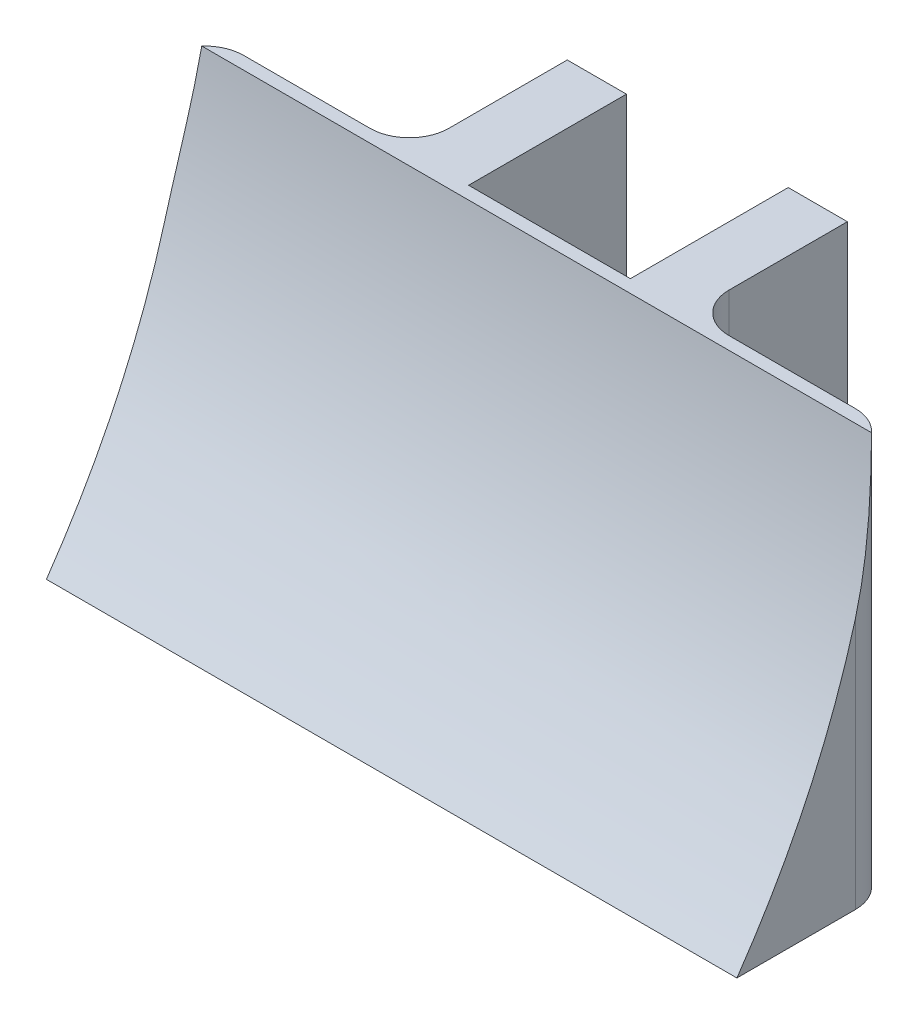
ISO-10303-21;
HEADER;
FILE_DESCRIPTION(('STEP AP214'),'2;1');
FILE_NAME('part.step','',(''),(''),'','','');
FILE_SCHEMA(('AUTOMOTIVE_DESIGN { 1 0 10303 214 1 1 1 1 }'));
ENDSEC;
DATA;
#1=APPLICATION_CONTEXT('core data for automotive mechanical design processes');
#2=APPLICATION_PROTOCOL_DEFINITION('international standard','automotive_design',2000,#1);
#3=PRODUCT_CONTEXT('',#1,'mechanical');
#4=PRODUCT('Part','Part','',(#3));
#5=PRODUCT_RELATED_PRODUCT_CATEGORY('part','',(#4));
#6=PRODUCT_DEFINITION_FORMATION('','',#4);
#7=PRODUCT_DEFINITION_CONTEXT('part definition',#1,'design');
#8=PRODUCT_DEFINITION('design','',#6,#7);
#9=PRODUCT_DEFINITION_SHAPE('','',#8);
#10=(LENGTH_UNIT() NAMED_UNIT(*) SI_UNIT(.MILLI.,.METRE.));
#11=(NAMED_UNIT(*) PLANE_ANGLE_UNIT() SI_UNIT($,.RADIAN.));
#12=(NAMED_UNIT(*) SI_UNIT($,.STERADIAN.) SOLID_ANGLE_UNIT());
#13=UNCERTAINTY_MEASURE_WITH_UNIT(LENGTH_MEASURE(1.E-05),#10,'distance_accuracy_value','');
#14=(GEOMETRIC_REPRESENTATION_CONTEXT(3) GLOBAL_UNCERTAINTY_ASSIGNED_CONTEXT((#13)) GLOBAL_UNIT_ASSIGNED_CONTEXT((#10,
#11,#12)) REPRESENTATION_CONTEXT('',''));
#15=CARTESIAN_POINT('',(0.,0.,0.));
#16=DIRECTION('',(0.,0.,1.));
#17=DIRECTION('',(1.,0.,0.));
#18=AXIS2_PLACEMENT_3D('',#15,#16,#17);
#19=CARTESIAN_POINT('',(0.,0.,8.));
#20=DIRECTION('',(0.,0.,1.));
#21=DIRECTION('',(1.,0.,0.));
#22=AXIS2_PLACEMENT_3D('',#19,#20,#21);
#23=PLANE('',#22);
#24=DIRECTION('',(1.,0.,0.));
#25=VECTOR('',#24,1.);
#26=CARTESIAN_POINT('',(-17.5,-10.,8.));
#27=LINE('',#26,#25);
#28=CARTESIAN_POINT('',(-15.5,-10.,8.));
#29=VERTEX_POINT('',#28);
#30=CARTESIAN_POINT('',(-9.1,-10.,8.));
#31=VERTEX_POINT('',#30);
#32=EDGE_CURVE('E169',#29,#31,#27,.T.);
#33=ORIENTED_EDGE('',*,*,#32,.F.);
#34=DIRECTION('',(0.,-1.,0.));
#35=VECTOR('',#34,1.);
#36=CARTESIAN_POINT('',(-15.5,0.,8.));
#37=LINE('',#36,#35);
#38=CARTESIAN_POINT('',(-15.5,10.,8.));
#39=VERTEX_POINT('',#38);
#40=EDGE_CURVE('E330',#29,#39,#37,.F.);
#41=ORIENTED_EDGE('',*,*,#40,.T.);
#42=DIRECTION('',(-1.,0.,0.));
#43=VECTOR('',#42,1.);
#44=CARTESIAN_POINT('',(-17.5,10.,8.));
#45=LINE('',#44,#43);
#46=CARTESIAN_POINT('',(-9.1,10.,8.));
#47=VERTEX_POINT('',#46);
#48=EDGE_CURVE('E306',#47,#39,#45,.T.);
#49=ORIENTED_EDGE('',*,*,#48,.F.);
#50=DIRECTION('',(0.,-1.,0.));
#51=VECTOR('',#50,1.);
#52=CARTESIAN_POINT('',(-9.1,-10.,8.));
#53=LINE('',#52,#51);
#54=EDGE_CURVE('E331',#47,#31,#53,.T.);
#55=ORIENTED_EDGE('',*,*,#54,.T.);
#56=EDGE_LOOP('',(#33,#41,#49,#55));
#57=FACE_BOUND('',#56,.T.);
#58=ADVANCED_FACE('F45',(#57),#23,.F.);
#59=CARTESIAN_POINT('',(0.,10.,8.));
#60=DIRECTION('',(0.,-1.,0.));
#61=DIRECTION('',(0.,0.,-1.));
#62=AXIS2_PLACEMENT_3D('',#59,#60,#61);
#63=PLANE('',#62);
#64=DIRECTION('',(1.,0.,0.));
#65=VECTOR('',#64,1.);
#66=CARTESIAN_POINT('',(-82.5,9.99999999999999,8.65035068671189));
#67=LINE('',#66,#65);
#68=CARTESIAN_POINT('',(-16.9759562090865,9.99999999999999,8.65035068671189));
#69=VERTEX_POINT('',#68);
#70=CARTESIAN_POINT('',(16.9759562090865,10.,8.65035068671189));
#71=VERTEX_POINT('',#70);
#72=EDGE_CURVE('E178',#69,#71,#67,.T.);
#73=ORIENTED_EDGE('',*,*,#72,.T.);
#74=CARTESIAN_POINT('',(15.5,10.,10.));
#75=DIRECTION('',(0.,-1.,0.));
#76=DIRECTION('',(0.,0.,-1.));
#77=AXIS2_PLACEMENT_3D('',#74,#75,#76);
#78=CIRCLE('',#77,2.);
#79=CARTESIAN_POINT('',(15.5,10.,8.));
#80=VERTEX_POINT('',#79);
#81=EDGE_CURVE('E367',#71,#80,#78,.F.);
#82=ORIENTED_EDGE('',*,*,#81,.T.);
#83=CARTESIAN_POINT('',(9.1,10.,8.));
#84=VERTEX_POINT('',#83);
#85=EDGE_CURVE('E310',#80,#84,#45,.T.);
#86=ORIENTED_EDGE('',*,*,#85,.T.);
#87=CARTESIAN_POINT('',(9.1,10.,6.));
#88=DIRECTION('',(0.,-1.,0.));
#89=DIRECTION('',(0.,0.,-1.));
#90=AXIS2_PLACEMENT_3D('',#87,#88,#89);
#91=CIRCLE('',#90,2.);
#92=CARTESIAN_POINT('',(7.1,10.,6.));
#93=VERTEX_POINT('',#92);
#94=EDGE_CURVE('E11',#84,#93,#91,.T.);
#95=ORIENTED_EDGE('',*,*,#94,.T.);
#96=DIRECTION('',(0.,0.,-1.));
#97=VECTOR('',#96,1.);
#98=CARTESIAN_POINT('',(7.1,10.,8.));
#99=LINE('',#98,#97);
#100=CARTESIAN_POINT('',(7.1,10.,0.));
#101=VERTEX_POINT('',#100);
#102=EDGE_CURVE('E197',#93,#101,#99,.T.);
#103=ORIENTED_EDGE('',*,*,#102,.T.);
#104=DIRECTION('',(-1.,0.,0.));
#105=VECTOR('',#104,1.);
#106=CARTESIAN_POINT('',(0.,10.,0.));
#107=LINE('',#106,#105);
#108=CARTESIAN_POINT('',(4.1,10.,0.));
#109=VERTEX_POINT('',#108);
#110=EDGE_CURVE('E188',#101,#109,#107,.T.);
#111=ORIENTED_EDGE('',*,*,#110,.T.);
#112=DIRECTION('',(0.,0.,-1.));
#113=VECTOR('',#112,1.);
#114=CARTESIAN_POINT('',(4.1,10.,8.));
#115=LINE('',#114,#113);
#116=CARTESIAN_POINT('',(4.1,10.,8.));
#117=VERTEX_POINT('',#116);
#118=EDGE_CURVE('E221',#117,#109,#115,.T.);
#119=ORIENTED_EDGE('',*,*,#118,.F.);
#120=CARTESIAN_POINT('',(-4.1,10.,8.));
#121=VERTEX_POINT('',#120);
#122=EDGE_CURVE('E309',#117,#121,#45,.T.);
#123=ORIENTED_EDGE('',*,*,#122,.T.);
#124=DIRECTION('',(0.,0.,-1.));
#125=VECTOR('',#124,1.);
#126=CARTESIAN_POINT('',(-4.1,10.,8.));
#127=LINE('',#126,#125);
#128=CARTESIAN_POINT('',(-4.1,10.,0.));
#129=VERTEX_POINT('',#128);
#130=EDGE_CURVE('E301',#121,#129,#127,.T.);
#131=ORIENTED_EDGE('',*,*,#130,.T.);
#132=DIRECTION('',(1.,0.,0.));
#133=VECTOR('',#132,1.);
#134=CARTESIAN_POINT('',(0.,10.,0.));
#135=LINE('',#134,#133);
#136=CARTESIAN_POINT('',(-7.1,10.,0.));
#137=VERTEX_POINT('',#136);
#138=EDGE_CURVE('E289',#137,#129,#135,.T.);
#139=ORIENTED_EDGE('',*,*,#138,.F.);
#140=DIRECTION('',(0.,0.,-1.));
#141=VECTOR('',#140,1.);
#142=CARTESIAN_POINT('',(-7.1,10.,8.));
#143=LINE('',#142,#141);
#144=CARTESIAN_POINT('',(-7.1,10.,6.));
#145=VERTEX_POINT('',#144);
#146=EDGE_CURVE('E298',#145,#137,#143,.T.);
#147=ORIENTED_EDGE('',*,*,#146,.F.);
#148=CARTESIAN_POINT('',(-9.1,10.,6.));
#149=DIRECTION('',(0.,-1.,0.));
#150=DIRECTION('',(0.,0.,-1.));
#151=AXIS2_PLACEMENT_3D('',#148,#149,#150);
#152=CIRCLE('',#151,2.);
#153=EDGE_CURVE('E353',#145,#47,#152,.T.);
#154=ORIENTED_EDGE('',*,*,#153,.T.);
#155=ORIENTED_EDGE('',*,*,#48,.T.);
#156=CARTESIAN_POINT('',(-15.5,10.,10.));
#157=DIRECTION('',(0.,-1.,0.));
#158=DIRECTION('',(0.,0.,-1.));
#159=AXIS2_PLACEMENT_3D('',#156,#157,#158);
#160=CIRCLE('',#159,2.);
#161=EDGE_CURVE('E336',#39,#69,#160,.F.);
#162=ORIENTED_EDGE('',*,*,#161,.T.);
#163=EDGE_LOOP('',(#73,#82,#86,#95,#103,#111,#119,#123,#131,#139,#147,#154,#155,#162));
#164=FACE_BOUND('',#163,.T.);
#165=ADVANCED_FACE('F382',(#164),#63,.F.);
#166=CARTESIAN_POINT('',(4.1,0.,8.));
#167=DIRECTION('',(1.,0.,0.));
#168=DIRECTION('',(0.,0.,-1.));
#169=AXIS2_PLACEMENT_3D('',#166,#167,#168);
#170=PLANE('',#169);
#171=DIRECTION('',(0.,-1.,0.));
#172=VECTOR('',#171,1.);
#173=CARTESIAN_POINT('',(4.1,0.,0.));
#174=LINE('',#173,#172);
#175=CARTESIAN_POINT('',(4.1,-10.,0.));
#176=VERTEX_POINT('',#175);
#177=EDGE_CURVE('E202',#109,#176,#174,.T.);
#178=ORIENTED_EDGE('',*,*,#177,.T.);
#179=DIRECTION('',(0.,0.,-1.));
#180=VECTOR('',#179,1.);
#181=CARTESIAN_POINT('',(4.1,-10.,8.));
#182=LINE('',#181,#180);
#183=CARTESIAN_POINT('',(4.1,-10.,8.));
#184=VERTEX_POINT('',#183);
#185=EDGE_CURVE('E218',#184,#176,#182,.T.);
#186=ORIENTED_EDGE('',*,*,#185,.F.);
#187=DIRECTION('',(0.,-1.,0.));
#188=VECTOR('',#187,1.);
#189=CARTESIAN_POINT('',(4.1,0.,8.));
#190=LINE('',#189,#188);
#191=EDGE_CURVE('E193',#117,#184,#190,.T.);
#192=ORIENTED_EDGE('',*,*,#191,.F.);
#193=ORIENTED_EDGE('',*,*,#118,.T.);
#194=EDGE_LOOP('',(#178,#186,#192,#193));
#195=FACE_BOUND('',#194,.T.);
#196=ADVANCED_FACE('F399',(#195),#170,.F.);
#197=CARTESIAN_POINT('',(0.,-10.,8.));
#198=DIRECTION('',(0.,-1.,0.));
#199=DIRECTION('',(0.,0.,-1.));
#200=AXIS2_PLACEMENT_3D('',#197,#198,#199);
#201=PLANE('',#200);
#202=CARTESIAN_POINT('',(9.1,-10.,8.));
#203=VERTEX_POINT('',#202);
#204=CARTESIAN_POINT('',(15.5,-10.,8.));
#205=VERTEX_POINT('',#204);
#206=EDGE_CURVE('E318',#203,#205,#27,.T.);
#207=ORIENTED_EDGE('',*,*,#206,.T.);
#208=CARTESIAN_POINT('',(15.5,-10.,10.));
#209=DIRECTION('',(0.,-1.,0.));
#210=DIRECTION('',(0.,0.,-1.));
#211=AXIS2_PLACEMENT_3D('',#208,#209,#210);
#212=CIRCLE('',#211,2.);
#213=CARTESIAN_POINT('',(17.5,-10.,10.));
#214=VERTEX_POINT('',#213);
#215=EDGE_CURVE('E183',#205,#214,#212,.T.);
#216=ORIENTED_EDGE('',*,*,#215,.T.);
#217=DIRECTION('',(0.,0.,-1.));
#218=VECTOR('',#217,1.);
#219=CARTESIAN_POINT('',(17.5,-10.,16.));
#220=LINE('',#219,#218);
#221=CARTESIAN_POINT('',(17.5,-10.,16.));
#222=VERTEX_POINT('',#221);
#223=EDGE_CURVE('E168',#222,#214,#220,.T.);
#224=ORIENTED_EDGE('',*,*,#223,.F.);
#225=DIRECTION('',(1.,0.,0.));
#226=VECTOR('',#225,1.);
#227=CARTESIAN_POINT('',(-17.5,-10.,16.));
#228=LINE('',#227,#226);
#229=CARTESIAN_POINT('',(-17.5,-10.,16.));
#230=VERTEX_POINT('',#229);
#231=EDGE_CURVE('E158',#230,#222,#228,.T.);
#232=ORIENTED_EDGE('',*,*,#231,.F.);
#233=DIRECTION('',(0.,0.,-1.));
#234=VECTOR('',#233,1.);
#235=CARTESIAN_POINT('',(-17.5,-10.,16.));
#236=LINE('',#235,#234);
#237=CARTESIAN_POINT('',(-17.5,-10.,10.));
#238=VERTEX_POINT('',#237);
#239=EDGE_CURVE('E185',#230,#238,#236,.T.);
#240=ORIENTED_EDGE('',*,*,#239,.T.);
#241=CARTESIAN_POINT('',(-15.5,-10.,10.));
#242=DIRECTION('',(0.,-1.,0.));
#243=DIRECTION('',(0.,0.,-1.));
#244=AXIS2_PLACEMENT_3D('',#241,#242,#243);
#245=CIRCLE('',#244,2.);
#246=EDGE_CURVE('E327',#238,#29,#245,.T.);
#247=ORIENTED_EDGE('',*,*,#246,.T.);
#248=ORIENTED_EDGE('',*,*,#32,.T.);
#249=CARTESIAN_POINT('',(-9.1,-10.,6.));
#250=DIRECTION('',(0.,-1.,0.));
#251=DIRECTION('',(0.,0.,-1.));
#252=AXIS2_PLACEMENT_3D('',#249,#250,#251);
#253=CIRCLE('',#252,2.);
#254=CARTESIAN_POINT('',(-7.1,-10.,6.));
#255=VERTEX_POINT('',#254);
#256=EDGE_CURVE('E61',#31,#255,#253,.F.);
#257=ORIENTED_EDGE('',*,*,#256,.T.);
#258=DIRECTION('',(0.,0.,-1.));
#259=VECTOR('',#258,1.);
#260=CARTESIAN_POINT('',(-7.1,-10.,8.));
#261=LINE('',#260,#259);
#262=CARTESIAN_POINT('',(-7.1,-10.,0.));
#263=VERTEX_POINT('',#262);
#264=EDGE_CURVE('E280',#255,#263,#261,.T.);
#265=ORIENTED_EDGE('',*,*,#264,.T.);
#266=DIRECTION('',(1.,0.,0.));
#267=VECTOR('',#266,1.);
#268=CARTESIAN_POINT('',(0.,-10.,0.));
#269=LINE('',#268,#267);
#270=CARTESIAN_POINT('',(-4.1,-10.,0.));
#271=VERTEX_POINT('',#270);
#272=EDGE_CURVE('E272',#263,#271,#269,.T.);
#273=ORIENTED_EDGE('',*,*,#272,.T.);
#274=DIRECTION('',(0.,0.,-1.));
#275=VECTOR('',#274,1.);
#276=CARTESIAN_POINT('',(-4.1,-10.,8.));
#277=LINE('',#276,#275);
#278=CARTESIAN_POINT('',(-4.1,-10.,8.));
#279=VERTEX_POINT('',#278);
#280=EDGE_CURVE('E304',#279,#271,#277,.T.);
#281=ORIENTED_EDGE('',*,*,#280,.F.);
#282=EDGE_CURVE('E322',#279,#184,#27,.T.);
#283=ORIENTED_EDGE('',*,*,#282,.T.);
#284=ORIENTED_EDGE('',*,*,#185,.T.);
#285=DIRECTION('',(-1.,0.,0.));
#286=VECTOR('',#285,1.);
#287=CARTESIAN_POINT('',(0.,-10.,0.));
#288=LINE('',#287,#286);
#289=CARTESIAN_POINT('',(7.1,-10.,0.));
#290=VERTEX_POINT('',#289);
#291=EDGE_CURVE('E206',#290,#176,#288,.T.);
#292=ORIENTED_EDGE('',*,*,#291,.F.);
#293=DIRECTION('',(0.,0.,-1.));
#294=VECTOR('',#293,1.);
#295=CARTESIAN_POINT('',(7.1,-10.,8.));
#296=LINE('',#295,#294);
#297=CARTESIAN_POINT('',(7.1,-10.,6.));
#298=VERTEX_POINT('',#297);
#299=EDGE_CURVE('E215',#298,#290,#296,.T.);
#300=ORIENTED_EDGE('',*,*,#299,.F.);
#301=CARTESIAN_POINT('',(9.1,-10.,6.));
#302=DIRECTION('',(0.,-1.,0.));
#303=DIRECTION('',(0.,0.,-1.));
#304=AXIS2_PLACEMENT_3D('',#301,#302,#303);
#305=CIRCLE('',#304,2.);
#306=EDGE_CURVE('E54',#298,#203,#305,.F.);
#307=ORIENTED_EDGE('',*,*,#306,.T.);
#308=EDGE_LOOP('',(#207,#216,#224,#232,#240,#247,#248,#257,#265,#273,#281,#283,#284,#292,#300,#307));
#309=FACE_BOUND('',#308,.T.);
#310=ADVANCED_FACE('F181',(#309),#201,.T.);
#311=CARTESIAN_POINT('',(7.1,0.,8.));
#312=DIRECTION('',(1.,0.,0.));
#313=DIRECTION('',(0.,0.,-1.));
#314=AXIS2_PLACEMENT_3D('',#311,#312,#313);
#315=PLANE('',#314);
#316=ORIENTED_EDGE('',*,*,#102,.F.);
#317=DIRECTION('',(0.,-1.,0.));
#318=VECTOR('',#317,1.);
#319=CARTESIAN_POINT('',(7.1,0.,6.));
#320=LINE('',#319,#318);
#321=EDGE_CURVE('E342',#93,#298,#320,.T.);
#322=ORIENTED_EDGE('',*,*,#321,.T.);
#323=ORIENTED_EDGE('',*,*,#299,.T.);
#324=DIRECTION('',(0.,-1.,0.));
#325=VECTOR('',#324,1.);
#326=CARTESIAN_POINT('',(7.1,0.,0.));
#327=LINE('',#326,#325);
#328=EDGE_CURVE('E198',#101,#290,#327,.T.);
#329=ORIENTED_EDGE('',*,*,#328,.F.);
#330=EDGE_LOOP('',(#316,#322,#323,#329));
#331=FACE_BOUND('',#330,.T.);
#332=ADVANCED_FACE('F420',(#331),#315,.T.);
#333=CARTESIAN_POINT('',(0.,0.,0.));
#334=DIRECTION('',(0.,0.,1.));
#335=DIRECTION('',(1.,0.,0.));
#336=AXIS2_PLACEMENT_3D('',#333,#334,#335);
#337=PLANE('',#336);
#338=ORIENTED_EDGE('',*,*,#110,.F.);
#339=ORIENTED_EDGE('',*,*,#328,.T.);
#340=ORIENTED_EDGE('',*,*,#291,.T.);
#341=ORIENTED_EDGE('',*,*,#177,.F.);
#342=EDGE_LOOP('',(#338,#339,#340,#341));
#343=FACE_BOUND('',#342,.T.);
#344=ADVANCED_FACE('F403',(#343),#337,.F.);
#345=ORIENTED_EDGE('',*,*,#282,.F.);
#346=DIRECTION('',(0.,-1.,0.));
#347=VECTOR('',#346,1.);
#348=CARTESIAN_POINT('',(-4.1,0.,8.));
#349=LINE('',#348,#347);
#350=EDGE_CURVE('E273',#121,#279,#349,.T.);
#351=ORIENTED_EDGE('',*,*,#350,.F.);
#352=ORIENTED_EDGE('',*,*,#122,.F.);
#353=ORIENTED_EDGE('',*,*,#191,.T.);
#354=EDGE_LOOP('',(#345,#351,#352,#353));
#355=FACE_BOUND('',#354,.T.);
#356=ADVANCED_FACE('F395',(#355),#23,.F.);
#357=CARTESIAN_POINT('',(17.5,10.,16.));
#358=DIRECTION('',(-1.,0.,0.));
#359=DIRECTION('',(0.,0.,1.));
#360=AXIS2_PLACEMENT_3D('',#357,#358,#359);
#361=PLANE('',#360);
#362=ORIENTED_EDGE('',*,*,#223,.T.);
#363=DIRECTION('',(0.,1.,0.));
#364=VECTOR('',#363,1.);
#365=CARTESIAN_POINT('',(17.5,10.,10.));
#366=LINE('',#365,#364);
#367=CARTESIAN_POINT('',(17.5,2.74793727355855,9.99999999998389));
#368=VERTEX_POINT('',#367);
#369=EDGE_CURVE('E176',#214,#368,#366,.T.);
#370=ORIENTED_EDGE('',*,*,#369,.T.);
#371=CARTESIAN_POINT('',(17.5,-10.,16.));
#372=CARTESIAN_POINT('',(17.5,-0.993319634584633,9.76063905327184));
#373=CARTESIAN_POINT('',(17.5,10.,8.65035068671189));
#374=B_SPLINE_CURVE_WITH_KNOTS('',2,(#371,#372,#373),.UNSPECIFIED.,.F.,.F.,(3,3),(0.,1.),.UNSPECIFIED.);
#375=EDGE_CURVE('E161',#222,#368,#374,.T.);
#376=ORIENTED_EDGE('',*,*,#375,.F.);
#377=EDGE_LOOP('',(#362,#370,#376));
#378=FACE_BOUND('',#377,.T.);
#379=ADVANCED_FACE('F174',(#378),#361,.F.);
#380=CARTESIAN_POINT('',(-17.5,10.,16.));
#381=DIRECTION('',(1.,0.,0.));
#382=DIRECTION('',(0.,0.,-1.));
#383=AXIS2_PLACEMENT_3D('',#380,#381,#382);
#384=PLANE('',#383);
#385=CARTESIAN_POINT('',(-17.5,-10.,16.));
#386=CARTESIAN_POINT('',(-17.5,-0.993319634584633,9.76063905327184));
#387=CARTESIAN_POINT('',(-17.5,10.,8.65035068671189));
#388=B_SPLINE_CURVE_WITH_KNOTS('',2,(#385,#386,#387),.UNSPECIFIED.,.F.,.F.,(3,3),(0.,1.),.UNSPECIFIED.);
#389=CARTESIAN_POINT('',(-17.5,2.74793727355855,9.99999999998389));
#390=VERTEX_POINT('',#389);
#391=EDGE_CURVE('E163',#230,#390,#388,.T.);
#392=ORIENTED_EDGE('',*,*,#391,.T.);
#393=DIRECTION('',(0.,-1.,0.));
#394=VECTOR('',#393,1.);
#395=CARTESIAN_POINT('',(-17.5,10.,10.));
#396=LINE('',#395,#394);
#397=EDGE_CURVE('E344',#390,#238,#396,.T.);
#398=ORIENTED_EDGE('',*,*,#397,.T.);
#399=ORIENTED_EDGE('',*,*,#239,.F.);
#400=EDGE_LOOP('',(#392,#398,#399));
#401=FACE_BOUND('',#400,.T.);
#402=ADVANCED_FACE('F379',(#401),#384,.F.);
#403=ORIENTED_EDGE('',*,*,#85,.F.);
#404=DIRECTION('',(0.,1.,0.));
#405=VECTOR('',#404,1.);
#406=CARTESIAN_POINT('',(15.5,0.,8.));
#407=LINE('',#406,#405);
#408=EDGE_CURVE('E365',#80,#205,#407,.F.);
#409=ORIENTED_EDGE('',*,*,#408,.T.);
#410=ORIENTED_EDGE('',*,*,#206,.F.);
#411=DIRECTION('',(0.,-1.,0.));
#412=VECTOR('',#411,1.);
#413=CARTESIAN_POINT('',(9.1,0.,8.));
#414=LINE('',#413,#412);
#415=EDGE_CURVE('E363',#203,#84,#414,.F.);
#416=ORIENTED_EDGE('',*,*,#415,.T.);
#417=EDGE_LOOP('',(#403,#409,#410,#416));
#418=FACE_BOUND('',#417,.T.);
#419=ADVANCED_FACE('F362',(#418),#23,.F.);
#420=CARTESIAN_POINT('',(-4.1,0.,8.));
#421=DIRECTION('',(1.,0.,0.));
#422=DIRECTION('',(0.,0.,-1.));
#423=AXIS2_PLACEMENT_3D('',#420,#421,#422);
#424=PLANE('',#423);
#425=DIRECTION('',(0.,-1.,0.));
#426=VECTOR('',#425,1.);
#427=CARTESIAN_POINT('',(-4.1,0.,0.));
#428=LINE('',#427,#426);
#429=EDGE_CURVE('E285',#129,#271,#428,.T.);
#430=ORIENTED_EDGE('',*,*,#429,.F.);
#431=ORIENTED_EDGE('',*,*,#130,.F.);
#432=ORIENTED_EDGE('',*,*,#350,.T.);
#433=ORIENTED_EDGE('',*,*,#280,.T.);
#434=EDGE_LOOP('',(#430,#431,#432,#433));
#435=FACE_BOUND('',#434,.T.);
#436=ADVANCED_FACE('F406',(#435),#424,.T.);
#437=CARTESIAN_POINT('',(-7.1,0.,8.));
#438=DIRECTION('',(1.,0.,0.));
#439=DIRECTION('',(0.,0.,-1.));
#440=AXIS2_PLACEMENT_3D('',#437,#438,#439);
#441=PLANE('',#440);
#442=ORIENTED_EDGE('',*,*,#264,.F.);
#443=DIRECTION('',(0.,-1.,0.));
#444=VECTOR('',#443,1.);
#445=CARTESIAN_POINT('',(-7.1,10.,6.));
#446=LINE('',#445,#444);
#447=EDGE_CURVE('E338',#255,#145,#446,.F.);
#448=ORIENTED_EDGE('',*,*,#447,.T.);
#449=ORIENTED_EDGE('',*,*,#146,.T.);
#450=DIRECTION('',(0.,-1.,0.));
#451=VECTOR('',#450,1.);
#452=CARTESIAN_POINT('',(-7.1,0.,0.));
#453=LINE('',#452,#451);
#454=EDGE_CURVE('E281',#137,#263,#453,.T.);
#455=ORIENTED_EDGE('',*,*,#454,.T.);
#456=EDGE_LOOP('',(#442,#448,#449,#455));
#457=FACE_BOUND('',#456,.T.);
#458=ADVANCED_FACE('F411',(#457),#441,.F.);
#459=CARTESIAN_POINT('',(0.,0.,0.));
#460=DIRECTION('',(0.,0.,1.));
#461=DIRECTION('',(1.,0.,0.));
#462=AXIS2_PLACEMENT_3D('',#459,#460,#461);
#463=PLANE('',#462);
#464=ORIENTED_EDGE('',*,*,#272,.F.);
#465=ORIENTED_EDGE('',*,*,#454,.F.);
#466=ORIENTED_EDGE('',*,*,#138,.T.);
#467=ORIENTED_EDGE('',*,*,#429,.T.);
#468=EDGE_LOOP('',(#464,#465,#466,#467));
#469=FACE_BOUND('',#468,.T.);
#470=ADVANCED_FACE('F250',(#469),#463,.F.);
#471=CARTESIAN_POINT('',(-82.5,-10.,16.));
#472=CARTESIAN_POINT('',(-82.5,-0.993319634584633,9.76063905327184));
#473=CARTESIAN_POINT('',(-82.5,10.,8.65035068671189));
#474=B_SPLINE_CURVE_WITH_KNOTS('',2,(#471,#472,#473),.UNSPECIFIED.,.F.,.F.,(3,3),(0.,1.),.UNSPECIFIED.);
#475=DIRECTION('',(1.,0.,0.));
#476=VECTOR('',#475,1.);
#477=SURFACE_OF_LINEAR_EXTRUSION('',#474,#476);
#478=ORIENTED_EDGE('',*,*,#375,.T.);
#479=CARTESIAN_POINT('',(17.5,2.747937273563,10.));
#480=CARTESIAN_POINT('',(17.4999780873082,2.96311641456703,9.94043887519914));
#481=CARTESIAN_POINT('',(17.497340256262,3.17875548604895,9.88260583019924));
#482=CARTESIAN_POINT('',(17.4875825706697,3.61075010720856,9.77042146471678));
#483=CARTESIAN_POINT('',(17.4804644473526,3.82710534804373,9.7160688083115));
#484=CARTESIAN_POINT('',(17.4624956202193,4.26047595169996,9.6108294769491));
#485=CARTESIAN_POINT('',(17.4516452497898,4.47749125384483,9.55994249290352));
#486=CARTESIAN_POINT('',(17.4268697328854,4.91160761386301,9.46173162151336));
#487=CARTESIAN_POINT('',(17.4129519261369,5.12870725254839,9.41439958442343));
#488=CARTESIAN_POINT('',(17.3825976036345,5.56346217340621,9.32314100019821));
#489=CARTESIAN_POINT('',(17.3661608760545,5.7811175007936,9.27921473993646));
#490=CARTESIAN_POINT('',(17.331297453585,6.21692730438456,9.19474400642566));
#491=CARTESIAN_POINT('',(17.312870721701,6.43508178979371,9.15419959607042));
#492=CARTESIAN_POINT('',(17.2774792637091,6.83825692384323,9.08244237597254));
#493=CARTESIAN_POINT('',(17.2607257383788,7.02321175429393,9.05075355822059));
#494=CARTESIAN_POINT('',(17.2264508002172,7.39343397299065,8.98975676569054));
#495=CARTESIAN_POINT('',(17.2089294211418,7.57870134715331,8.96044868641389));
#496=CARTESIAN_POINT('',(17.1734126333568,7.94954583478291,8.904191337327));
#497=CARTESIAN_POINT('',(17.1554172302707,8.13512294455096,8.87724203955055));
#498=CARTESIAN_POINT('',(17.1192114449726,8.50696466051732,8.82562778479478));
#499=CARTESIAN_POINT('',(17.1010006978074,8.69322989626202,8.80096762179216));
#500=CARTESIAN_POINT('',(17.064703269022,9.06606765564129,8.75397237930601));
#501=CARTESIAN_POINT('',(17.0466165887696,9.25264018263569,8.73163732541831));
#502=CARTESIAN_POINT('',(17.0108802630984,9.62609161368902,8.68927116604622));
#503=CARTESIAN_POINT('',(16.9932306251584,9.81297052293253,8.66924009996665));
#504=CARTESIAN_POINT('',(16.9759562090865,10.,8.65035068671189));
#505=B_SPLINE_CURVE_WITH_KNOTS('',3,(#479,#480,#481,#482,#483,#484,#485,#486,#487,#488,#489,
#490,#491,#492,#493,#494,#495,#496,#497,#498,#499,#500,#501,#502,#503,#504),.UNSPECIFIED.,.F.,
.F.,(4,2,2,2,2,2,2,2,2,2,2,2,4),(0.,0.669762945520047,1.33926724680416,2.0087117594641,
2.67657149557604,3.34448742550743,4.01241577420917,4.57758764928373,5.14273470365844,
5.70787505662035,6.27417343371387,6.84047804420905,7.40679233869926),.UNSPECIFIED.);
#506=EDGE_CURVE('E236',#368,#71,#505,.T.);
#507=ORIENTED_EDGE('',*,*,#506,.T.);
#508=ORIENTED_EDGE('',*,*,#72,.F.);
#509=CARTESIAN_POINT('',(-16.9759562090865,9.99999999999999,8.65035068671189));
#510=CARTESIAN_POINT('',(-16.9963440503793,9.7792742347469,8.6726433724123));
#511=CARTESIAN_POINT('',(-17.01725285042,9.55875816047928,8.69652607493841));
#512=CARTESIAN_POINT('',(-17.0596021686052,9.11813648333672,8.74750772822612));
#513=CARTESIAN_POINT('',(-17.0810427165308,8.89803090419765,8.77460685945065));
#514=CARTESIAN_POINT('',(-17.1239433593914,8.45824165908085,8.8320556683083));
#515=CARTESIAN_POINT('',(-17.1454034547113,8.23855800168946,8.86240541139446));
#516=CARTESIAN_POINT('',(-17.1877959989395,7.80017678711369,8.92630957476771));
#517=CARTESIAN_POINT('',(-17.2087296422777,7.58147814033784,8.95985571820105));
#518=CARTESIAN_POINT('',(-17.2496410664016,7.14452678628527,9.03025074174165));
#519=CARTESIAN_POINT('',(-17.2696188645436,6.92627407098021,9.06709956184348));
#520=CARTESIAN_POINT('',(-17.3081340195817,6.49022724934174,9.14413429880464));
#521=CARTESIAN_POINT('',(-17.3266713638817,6.27243314703489,9.18432024483923));
#522=CARTESIAN_POINT('',(-17.3591620616343,5.87008861534191,9.26175610837589));
#523=CARTESIAN_POINT('',(-17.3733853795463,5.68546974764854,9.29853721057367));
#524=CARTESIAN_POINT('',(-17.4001130984001,5.31661462200344,9.37454559555434));
#525=CARTESIAN_POINT('',(-17.4126175387033,5.13237835538553,9.4137728222923));
#526=CARTESIAN_POINT('',(-17.4355687329694,4.76432903980051,9.49468587236501));
#527=CARTESIAN_POINT('',(-17.4460156190226,4.5805159644147,9.53637153765006));
#528=CARTESIAN_POINT('',(-17.4645053366692,4.21295697725229,9.62230458829109));
#529=CARTESIAN_POINT('',(-17.4725430512778,4.02921202482891,9.66655719126));
#530=CARTESIAN_POINT('',(-17.485783715108,3.66222065088809,9.75755287596572));
#531=CARTESIAN_POINT('',(-17.4909864720144,3.47897426403066,9.8042961264246));
#532=CARTESIAN_POINT('',(-17.4980891351826,3.11301980007972,9.90027909935687));
#533=CARTESIAN_POINT('',(-17.4999881325628,2.93031188491886,9.94951950497763));
#534=CARTESIAN_POINT('',(-17.5,2.74793727355983,9.99999999998354));
#535=B_SPLINE_CURVE_WITH_KNOTS('',3,(#509,#510,#511,#512,#513,#514,#515,#516,#517,#518,#519,
#520,#521,#522,#523,#524,#525,#526,#527,#528,#529,#530,#531,#532,#533,#534),.UNSPECIFIED.,.F.,
.F.,(4,2,2,2,2,2,2,2,2,2,2,2,4),(0.,0.668342949273621,1.33672341474824,2.00511734099873,
2.6718252555291,3.33852105927821,4.00522269231843,4.57155182872969,5.13786799432916,
5.70414779182983,6.27162195843684,6.83913461601668,7.40680337461152),.UNSPECIFIED.);
#536=EDGE_CURVE('E227',#69,#390,#535,.T.);
#537=ORIENTED_EDGE('',*,*,#536,.T.);
#538=ORIENTED_EDGE('',*,*,#391,.F.);
#539=ORIENTED_EDGE('',*,*,#231,.T.);
#540=EDGE_LOOP('',(#478,#507,#508,#537,#538,#539));
#541=FACE_BOUND('',#540,.T.);
#542=ADVANCED_FACE('F160',(#541),#477,.F.);
#543=CARTESIAN_POINT('',(15.5,10.,10.));
#544=DIRECTION('',(0.,1.,0.));
#545=DIRECTION('',(0.,0.,1.));
#546=AXIS2_PLACEMENT_3D('',#543,#544,#545);
#547=CYLINDRICAL_SURFACE('',#546,2.);
#548=ORIENTED_EDGE('',*,*,#215,.F.);
#549=ORIENTED_EDGE('',*,*,#408,.F.);
#550=ORIENTED_EDGE('',*,*,#81,.F.);
#551=ORIENTED_EDGE('',*,*,#506,.F.);
#552=ORIENTED_EDGE('',*,*,#369,.F.);
#553=EDGE_LOOP('',(#548,#549,#550,#551,#552));
#554=FACE_BOUND('',#553,.T.);
#555=ADVANCED_FACE('F249',(#554),#547,.T.);
#556=CARTESIAN_POINT('',(-15.5,10.,10.));
#557=DIRECTION('',(0.,-1.,0.));
#558=DIRECTION('',(0.,0.,-1.));
#559=AXIS2_PLACEMENT_3D('',#556,#557,#558);
#560=CYLINDRICAL_SURFACE('',#559,2.);
#561=ORIENTED_EDGE('',*,*,#161,.F.);
#562=ORIENTED_EDGE('',*,*,#40,.F.);
#563=ORIENTED_EDGE('',*,*,#246,.F.);
#564=ORIENTED_EDGE('',*,*,#397,.F.);
#565=ORIENTED_EDGE('',*,*,#536,.F.);
#566=EDGE_LOOP('',(#561,#562,#563,#564,#565));
#567=FACE_BOUND('',#566,.T.);
#568=ADVANCED_FACE('F243',(#567),#560,.T.);
#569=CARTESIAN_POINT('',(-9.1,0.,6.));
#570=DIRECTION('',(0.,1.,0.));
#571=DIRECTION('',(0.,0.,1.));
#572=AXIS2_PLACEMENT_3D('',#569,#570,#571);
#573=CYLINDRICAL_SURFACE('',#572,2.);
#574=ORIENTED_EDGE('',*,*,#153,.F.);
#575=ORIENTED_EDGE('',*,*,#447,.F.);
#576=ORIENTED_EDGE('',*,*,#256,.F.);
#577=ORIENTED_EDGE('',*,*,#54,.F.);
#578=EDGE_LOOP('',(#574,#575,#576,#577));
#579=FACE_BOUND('',#578,.T.);
#580=ADVANCED_FACE('F390',(#579),#573,.F.);
#581=CARTESIAN_POINT('',(9.1,0.,6.));
#582=DIRECTION('',(0.,-1.,0.));
#583=DIRECTION('',(0.,0.,-1.));
#584=AXIS2_PLACEMENT_3D('',#581,#582,#583);
#585=CYLINDRICAL_SURFACE('',#584,2.);
#586=ORIENTED_EDGE('',*,*,#94,.F.);
#587=ORIENTED_EDGE('',*,*,#415,.F.);
#588=ORIENTED_EDGE('',*,*,#306,.F.);
#589=ORIENTED_EDGE('',*,*,#321,.F.);
#590=EDGE_LOOP('',(#586,#587,#588,#589));
#591=FACE_BOUND('',#590,.T.);
#592=ADVANCED_FACE('F47',(#591),#585,.F.);
#593=CLOSED_SHELL('',(#58,#165,#196,#310,#332,#344,#356,#379,#402,#419,#436,#458,#470,#542,#555,
#568,#580,#592));
#594=MANIFOLD_SOLID_BREP('B2',#593);
#595=ADVANCED_BREP_SHAPE_REPRESENTATION('',(#18,#594),#14);
#596=SHAPE_DEFINITION_REPRESENTATION(#9,#595);
ENDSEC;
END-ISO-10303-21;
